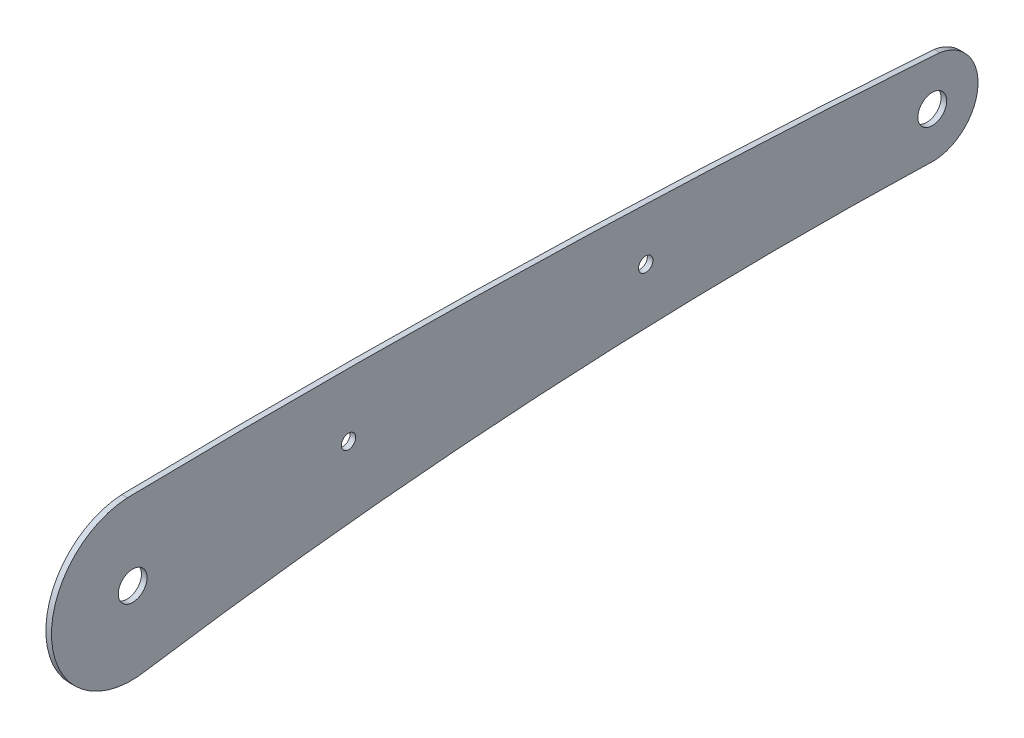
ISO-10303-21;
HEADER;
FILE_DESCRIPTION(('STEP AP214'),'2;1');
FILE_NAME('part.step','',(''),(''),'','','');
FILE_SCHEMA(('AUTOMOTIVE_DESIGN { 1 0 10303 214 1 1 1 1 }'));
ENDSEC;
DATA;
#1=APPLICATION_CONTEXT('core data for automotive mechanical design processes');
#2=APPLICATION_PROTOCOL_DEFINITION('international standard','automotive_design',2000,#1);
#3=PRODUCT_CONTEXT('',#1,'mechanical');
#4=PRODUCT('Part','Part','',(#3));
#5=PRODUCT_RELATED_PRODUCT_CATEGORY('part','',(#4));
#6=PRODUCT_DEFINITION_FORMATION('','',#4);
#7=PRODUCT_DEFINITION_CONTEXT('part definition',#1,'design');
#8=PRODUCT_DEFINITION('design','',#6,#7);
#9=PRODUCT_DEFINITION_SHAPE('','',#8);
#10=(LENGTH_UNIT() NAMED_UNIT(*) SI_UNIT(.MILLI.,.METRE.));
#11=(NAMED_UNIT(*) PLANE_ANGLE_UNIT() SI_UNIT($,.RADIAN.));
#12=(NAMED_UNIT(*) SI_UNIT($,.STERADIAN.) SOLID_ANGLE_UNIT());
#13=UNCERTAINTY_MEASURE_WITH_UNIT(LENGTH_MEASURE(1.E-05),#10,'distance_accuracy_value','');
#14=(GEOMETRIC_REPRESENTATION_CONTEXT(3) GLOBAL_UNCERTAINTY_ASSIGNED_CONTEXT((#13)) GLOBAL_UNIT_ASSIGNED_CONTEXT((#10,
#11,#12)) REPRESENTATION_CONTEXT('',''));
#15=CARTESIAN_POINT('',(0.,0.,0.));
#16=DIRECTION('',(0.,0.,1.));
#17=DIRECTION('',(1.,0.,0.));
#18=AXIS2_PLACEMENT_3D('',#15,#16,#17);
#19=CARTESIAN_POINT('',(1.5,0.0109238249300647,-111.842380336312));
#20=DIRECTION('',(1.,0.,0.));
#21=DIRECTION('',(0.,0.,-1.));
#22=AXIS2_PLACEMENT_3D('',#19,#20,#21);
#23=PLANE('',#22);
#24=CARTESIAN_POINT('',(1.5,4.68666504729787,44.4328136526777));
#25=DIRECTION('',(1.,0.,0.));
#26=DIRECTION('',(0.,0.,-1.));
#27=AXIS2_PLACEMENT_3D('',#24,#25,#26);
#28=CIRCLE('',#27,1.92499999999995);
#29=CARTESIAN_POINT('',(1.5,4.68666504729787,42.5078136526778));
#30=VERTEX_POINT('',#29);
#31=EDGE_CURVE('E171',#30,#30,#28,.T.);
#32=ORIENTED_EDGE('',*,*,#31,.F.);
#33=EDGE_LOOP('',(#32));
#34=FACE_BOUND('',#33,.T.);
#35=CARTESIAN_POINT('',(1.5,0.133331517138124,102.143981394812));
#36=DIRECTION('',(1.,0.,0.));
#37=DIRECTION('',(0.,0.,-1.));
#38=AXIS2_PLACEMENT_3D('',#35,#36,#37);
#39=CIRCLE('',#38,3.85);
#40=CARTESIAN_POINT('',(1.5,0.133331517138124,98.2939813948124));
#41=VERTEX_POINT('',#40);
#42=EDGE_CURVE('E111',#41,#41,#39,.T.);
#43=ORIENTED_EDGE('',*,*,#42,.F.);
#44=EDGE_LOOP('',(#43));
#45=FACE_BOUND('',#44,.T.);
#46=CARTESIAN_POINT('',(1.5,-3.59948538258381,-112.079421326813));
#47=DIRECTION('',(1.,0.,0.));
#48=DIRECTION('',(0.,0.,-1.));
#49=AXIS2_PLACEMENT_3D('',#46,#47,#48);
#50=CIRCLE('',#49,4.9999999999999);
#51=CARTESIAN_POINT('',(1.5,-8.57201186270506,-111.555989951663));
#52=VERTEX_POINT('',#51);
#53=CARTESIAN_POINT('',(1.5,-8.58874368837342,-112.406990492162));
#54=VERTEX_POINT('',#53);
#55=EDGE_CURVE('E116',#52,#54,#50,.T.);
#56=ORIENTED_EDGE('',*,*,#55,.T.);
#57=CARTESIAN_POINT('',(1.5,3.62133303244394,-111.605339345811));
#58=DIRECTION('',(1.,0.,0.));
#59=DIRECTION('',(0.,0.,-1.));
#60=AXIS2_PLACEMENT_3D('',#57,#58,#59);
#61=CIRCLE('',#60,12.2363645781209);
#62=CARTESIAN_POINT('',(1.5,15.6965768285633,-113.584507189356));
#63=VERTEX_POINT('',#62);
#64=EDGE_CURVE('E83',#54,#63,#61,.T.);
#65=ORIENTED_EDGE('',*,*,#64,.T.);
#66=CARTESIAN_POINT('',(1.5,-2413.07294376536,56.6324226054489));
#67=DIRECTION('',(1.,0.,0.));
#68=DIRECTION('',(0.,0.,-1.));
#69=AXIS2_PLACEMENT_3D('',#66,#67,#68);
#70=CIRCLE('',#69,2434.72692254281);
#71=CARTESIAN_POINT('',(1.5,21.2020403196569,103.541794938654));
#72=VERTEX_POINT('',#71);
#73=EDGE_CURVE('E87',#63,#72,#70,.T.);
#74=ORIENTED_EDGE('',*,*,#73,.T.);
#75=CARTESIAN_POINT('',(1.5,-0.210717527640014,102.398442674119));
#76=DIRECTION('',(1.,0.,0.));
#77=DIRECTION('',(0.,0.,-1.));
#78=AXIS2_PLACEMENT_3D('',#75,#76,#77);
#79=CIRCLE('',#78,21.4432612498145);
#80=CARTESIAN_POINT('',(1.5,-21.2449303278428,98.2300683023075));
#81=VERTEX_POINT('',#80);
#82=EDGE_CURVE('E91',#72,#81,#79,.T.);
#83=ORIENTED_EDGE('',*,*,#82,.T.);
#84=CARTESIAN_POINT('',(1.5,-1165.50616564437,-76.1691562818783));
#85=DIRECTION('',(-1.,0.,0.));
#86=DIRECTION('',(0.,0.,-1.));
#87=AXIS2_PLACEMENT_3D('',#84,#85,#86);
#88=CIRCLE('',#87,1157.475211045);
#89=EDGE_CURVE('E49',#81,#52,#88,.T.);
#90=ORIENTED_EDGE('',*,*,#89,.T.);
#91=EDGE_LOOP('',(#56,#65,#74,#83,#90));
#92=FACE_BOUND('',#91,.T.);
#93=CARTESIAN_POINT('',(1.5,5.98288182663587,-35.0010555414686));
#94=DIRECTION('',(1.,0.,0.));
#95=DIRECTION('',(0.,0.,-1.));
#96=AXIS2_PLACEMENT_3D('',#93,#94,#95);
#97=CIRCLE('',#96,1.92499999999995);
#98=CARTESIAN_POINT('',(1.5,5.98288182663587,-36.9260555414685));
#99=VERTEX_POINT('',#98);
#100=EDGE_CURVE('E177',#99,#99,#97,.T.);
#101=ORIENTED_EDGE('',*,*,#100,.F.);
#102=EDGE_LOOP('',(#101));
#103=FACE_BOUND('',#102,.T.);
#104=CARTESIAN_POINT('',(1.5,3.62133303244394,-111.605339345811));
#105=DIRECTION('',(1.,0.,0.));
#106=DIRECTION('',(0.,0.,-1.));
#107=AXIS2_PLACEMENT_3D('',#104,#105,#106);
#108=CIRCLE('',#107,3.85);
#109=CARTESIAN_POINT('',(1.5,3.62133303244394,-115.455339345811));
#110=VERTEX_POINT('',#109);
#111=EDGE_CURVE('E162',#110,#110,#108,.T.);
#112=ORIENTED_EDGE('',*,*,#111,.F.);
#113=EDGE_LOOP('',(#112));
#114=FACE_BOUND('',#113,.T.);
#115=ADVANCED_FACE('F32',(#34,#45,#92,#103,#114),#23,.T.);
#116=CARTESIAN_POINT('',(0.,0.0109238249300647,-111.842380336312));
#117=DIRECTION('',(1.,0.,0.));
#118=DIRECTION('',(0.,0.,-1.));
#119=AXIS2_PLACEMENT_3D('',#116,#117,#118);
#120=PLANE('',#119);
#121=CARTESIAN_POINT('',(0.,-3.59948538258381,-112.079421326813));
#122=DIRECTION('',(1.,0.,0.));
#123=DIRECTION('',(0.,0.,-1.));
#124=AXIS2_PLACEMENT_3D('',#121,#122,#123);
#125=CIRCLE('',#124,4.9999999999999);
#126=CARTESIAN_POINT('',(0.,-8.57201186270506,-111.555989951663));
#127=VERTEX_POINT('',#126);
#128=CARTESIAN_POINT('',(0.,-8.58874368837342,-112.406990492162));
#129=VERTEX_POINT('',#128);
#130=EDGE_CURVE('E107',#127,#129,#125,.T.);
#131=ORIENTED_EDGE('',*,*,#130,.F.);
#132=CARTESIAN_POINT('',(0.,-1165.50616564437,-76.1691562818783));
#133=DIRECTION('',(-1.,0.,0.));
#134=DIRECTION('',(0.,0.,-1.));
#135=AXIS2_PLACEMENT_3D('',#132,#133,#134);
#136=CIRCLE('',#135,1157.475211045);
#137=CARTESIAN_POINT('',(0.,-21.2449303278428,98.2300683023075));
#138=VERTEX_POINT('',#137);
#139=EDGE_CURVE('E75',#138,#127,#136,.T.);
#140=ORIENTED_EDGE('',*,*,#139,.F.);
#141=CARTESIAN_POINT('',(0.,-0.210717527640014,102.398442674119));
#142=DIRECTION('',(1.,0.,0.));
#143=DIRECTION('',(0.,0.,-1.));
#144=AXIS2_PLACEMENT_3D('',#141,#142,#143);
#145=CIRCLE('',#144,21.4432612498145);
#146=CARTESIAN_POINT('',(0.,21.2020403196569,103.541794938654));
#147=VERTEX_POINT('',#146);
#148=EDGE_CURVE('E69',#147,#138,#145,.T.);
#149=ORIENTED_EDGE('',*,*,#148,.F.);
#150=CARTESIAN_POINT('',(0.,-2413.07294376536,56.6324226054489));
#151=DIRECTION('',(1.,0.,0.));
#152=DIRECTION('',(0.,0.,-1.));
#153=AXIS2_PLACEMENT_3D('',#150,#151,#152);
#154=CIRCLE('',#153,2434.72692254281);
#155=CARTESIAN_POINT('',(0.,15.6965768285633,-113.584507189356));
#156=VERTEX_POINT('',#155);
#157=EDGE_CURVE('E98',#156,#147,#154,.T.);
#158=ORIENTED_EDGE('',*,*,#157,.F.);
#159=CARTESIAN_POINT('',(0.,3.62133303244394,-111.605339345811));
#160=DIRECTION('',(1.,0.,0.));
#161=DIRECTION('',(0.,0.,-1.));
#162=AXIS2_PLACEMENT_3D('',#159,#160,#161);
#163=CIRCLE('',#162,12.2363645781209);
#164=EDGE_CURVE('E110',#129,#156,#163,.T.);
#165=ORIENTED_EDGE('',*,*,#164,.F.);
#166=EDGE_LOOP('',(#131,#140,#149,#158,#165));
#167=FACE_BOUND('',#166,.T.);
#168=CARTESIAN_POINT('',(0.,0.133331517138124,102.143981394812));
#169=DIRECTION('',(1.,0.,0.));
#170=DIRECTION('',(0.,0.,-1.));
#171=AXIS2_PLACEMENT_3D('',#168,#169,#170);
#172=CIRCLE('',#171,3.85);
#173=CARTESIAN_POINT('',(0.,0.133331517138124,98.2939813948124));
#174=VERTEX_POINT('',#173);
#175=EDGE_CURVE('E180',#174,#174,#172,.T.);
#176=ORIENTED_EDGE('',*,*,#175,.T.);
#177=EDGE_LOOP('',(#176));
#178=FACE_BOUND('',#177,.T.);
#179=CARTESIAN_POINT('',(0.,5.98288182663587,-35.0010555414686));
#180=DIRECTION('',(1.,0.,0.));
#181=DIRECTION('',(0.,0.,-1.));
#182=AXIS2_PLACEMENT_3D('',#179,#180,#181);
#183=CIRCLE('',#182,1.92499999999995);
#184=CARTESIAN_POINT('',(0.,5.98288182663587,-36.9260555414685));
#185=VERTEX_POINT('',#184);
#186=EDGE_CURVE('E174',#185,#185,#183,.T.);
#187=ORIENTED_EDGE('',*,*,#186,.T.);
#188=EDGE_LOOP('',(#187));
#189=FACE_BOUND('',#188,.T.);
#190=CARTESIAN_POINT('',(0.,4.68666504729787,44.4328136526777));
#191=DIRECTION('',(1.,0.,0.));
#192=DIRECTION('',(0.,0.,-1.));
#193=AXIS2_PLACEMENT_3D('',#190,#191,#192);
#194=CIRCLE('',#193,1.92499999999995);
#195=CARTESIAN_POINT('',(0.,4.68666504729787,42.5078136526778));
#196=VERTEX_POINT('',#195);
#197=EDGE_CURVE('E168',#196,#196,#194,.T.);
#198=ORIENTED_EDGE('',*,*,#197,.T.);
#199=EDGE_LOOP('',(#198));
#200=FACE_BOUND('',#199,.T.);
#201=CARTESIAN_POINT('',(0.,3.62133303244394,-111.605339345811));
#202=DIRECTION('',(1.,0.,0.));
#203=DIRECTION('',(0.,0.,-1.));
#204=AXIS2_PLACEMENT_3D('',#201,#202,#203);
#205=CIRCLE('',#204,3.85);
#206=CARTESIAN_POINT('',(0.,3.62133303244394,-115.455339345811));
#207=VERTEX_POINT('',#206);
#208=EDGE_CURVE('E165',#207,#207,#205,.T.);
#209=ORIENTED_EDGE('',*,*,#208,.T.);
#210=EDGE_LOOP('',(#209));
#211=FACE_BOUND('',#210,.T.);
#212=ADVANCED_FACE('F120',(#167,#178,#189,#200,#211),#120,.F.);
#213=CARTESIAN_POINT('',(1.5,-3.59948538258381,-112.079421326813));
#214=DIRECTION('',(-1.,0.,0.));
#215=DIRECTION('',(0.,0.,1.));
#216=AXIS2_PLACEMENT_3D('',#213,#214,#215);
#217=CYLINDRICAL_SURFACE('',#216,4.9999999999999);
#218=ORIENTED_EDGE('',*,*,#130,.T.);
#219=DIRECTION('',(-1.,0.,0.));
#220=VECTOR('',#219,1.);
#221=CARTESIAN_POINT('',(1.5,-8.58874368837342,-112.406990492162));
#222=LINE('',#221,#220);
#223=EDGE_CURVE('E11',#54,#129,#222,.T.);
#224=ORIENTED_EDGE('',*,*,#223,.F.);
#225=ORIENTED_EDGE('',*,*,#55,.F.);
#226=DIRECTION('',(-1.,0.,0.));
#227=VECTOR('',#226,1.);
#228=CARTESIAN_POINT('',(1.5,-8.57201186270506,-111.555989951663));
#229=LINE('',#228,#227);
#230=EDGE_CURVE('E103',#52,#127,#229,.T.);
#231=ORIENTED_EDGE('',*,*,#230,.T.);
#232=EDGE_LOOP('',(#218,#224,#225,#231));
#233=FACE_BOUND('',#232,.T.);
#234=ADVANCED_FACE('F34',(#233),#217,.T.);
#235=CARTESIAN_POINT('',(1.5,3.62133303244394,-111.605339345811));
#236=DIRECTION('',(-1.,0.,0.));
#237=DIRECTION('',(0.,0.,1.));
#238=AXIS2_PLACEMENT_3D('',#235,#236,#237);
#239=CYLINDRICAL_SURFACE('',#238,12.2363645781209);
#240=ORIENTED_EDGE('',*,*,#164,.T.);
#241=DIRECTION('',(-1.,0.,0.));
#242=VECTOR('',#241,1.);
#243=CARTESIAN_POINT('',(1.5,15.6965768285633,-113.584507189356));
#244=LINE('',#243,#242);
#245=EDGE_CURVE('E41',#63,#156,#244,.T.);
#246=ORIENTED_EDGE('',*,*,#245,.F.);
#247=ORIENTED_EDGE('',*,*,#64,.F.);
#248=ORIENTED_EDGE('',*,*,#223,.T.);
#249=EDGE_LOOP('',(#240,#246,#247,#248));
#250=FACE_BOUND('',#249,.T.);
#251=ADVANCED_FACE('F229',(#250),#239,.T.);
#252=CARTESIAN_POINT('',(1.5,-2413.07294376536,56.6324226054489));
#253=DIRECTION('',(-1.,0.,0.));
#254=DIRECTION('',(0.,0.,1.));
#255=AXIS2_PLACEMENT_3D('',#252,#253,#254);
#256=CYLINDRICAL_SURFACE('',#255,2434.72692254281);
#257=ORIENTED_EDGE('',*,*,#157,.T.);
#258=DIRECTION('',(-1.,0.,0.));
#259=VECTOR('',#258,1.);
#260=CARTESIAN_POINT('',(1.5,21.2020403196569,103.541794938654));
#261=LINE('',#260,#259);
#262=EDGE_CURVE('E95',#72,#147,#261,.T.);
#263=ORIENTED_EDGE('',*,*,#262,.F.);
#264=ORIENTED_EDGE('',*,*,#73,.F.);
#265=ORIENTED_EDGE('',*,*,#245,.T.);
#266=EDGE_LOOP('',(#257,#263,#264,#265));
#267=FACE_BOUND('',#266,.T.);
#268=ADVANCED_FACE('F96',(#267),#256,.T.);
#269=CARTESIAN_POINT('',(1.5,-0.210717527640014,102.398442674119));
#270=DIRECTION('',(-1.,0.,0.));
#271=DIRECTION('',(0.,0.,1.));
#272=AXIS2_PLACEMENT_3D('',#269,#270,#271);
#273=CYLINDRICAL_SURFACE('',#272,21.4432612498145);
#274=ORIENTED_EDGE('',*,*,#148,.T.);
#275=DIRECTION('',(-1.,0.,0.));
#276=VECTOR('',#275,1.);
#277=CARTESIAN_POINT('',(1.5,-21.2449303278428,98.2300683023075));
#278=LINE('',#277,#276);
#279=EDGE_CURVE('E99',#81,#138,#278,.T.);
#280=ORIENTED_EDGE('',*,*,#279,.F.);
#281=ORIENTED_EDGE('',*,*,#82,.F.);
#282=ORIENTED_EDGE('',*,*,#262,.T.);
#283=EDGE_LOOP('',(#274,#280,#281,#282));
#284=FACE_BOUND('',#283,.T.);
#285=ADVANCED_FACE('F101',(#284),#273,.T.);
#286=CARTESIAN_POINT('',(1.5,-1165.50616564437,-76.1691562818783));
#287=DIRECTION('',(-1.,0.,0.));
#288=DIRECTION('',(0.,0.,1.));
#289=AXIS2_PLACEMENT_3D('',#286,#287,#288);
#290=CYLINDRICAL_SURFACE('',#289,1157.475211045);
#291=ORIENTED_EDGE('',*,*,#139,.T.);
#292=ORIENTED_EDGE('',*,*,#230,.F.);
#293=ORIENTED_EDGE('',*,*,#89,.F.);
#294=ORIENTED_EDGE('',*,*,#279,.T.);
#295=EDGE_LOOP('',(#291,#292,#293,#294));
#296=FACE_BOUND('',#295,.T.);
#297=ADVANCED_FACE('F125',(#296),#290,.F.);
#298=CARTESIAN_POINT('',(1.5,0.133331517138124,102.143981394812));
#299=DIRECTION('',(-1.,0.,0.));
#300=DIRECTION('',(0.,0.,1.));
#301=AXIS2_PLACEMENT_3D('',#298,#299,#300);
#302=CYLINDRICAL_SURFACE('',#301,3.85);
#303=ORIENTED_EDGE('',*,*,#42,.T.);
#304=EDGE_LOOP('',(#303));
#305=FACE_BOUND('',#304,.T.);
#306=ORIENTED_EDGE('',*,*,#175,.F.);
#307=EDGE_LOOP('',(#306));
#308=FACE_BOUND('',#307,.T.);
#309=ADVANCED_FACE('F127',(#305,#308),#302,.F.);
#310=CARTESIAN_POINT('',(1.5,5.98288182663587,-35.0010555414686));
#311=DIRECTION('',(-1.,0.,0.));
#312=DIRECTION('',(0.,0.,1.));
#313=AXIS2_PLACEMENT_3D('',#310,#311,#312);
#314=CYLINDRICAL_SURFACE('',#313,1.92499999999995);
#315=ORIENTED_EDGE('',*,*,#100,.T.);
#316=EDGE_LOOP('',(#315));
#317=FACE_BOUND('',#316,.T.);
#318=ORIENTED_EDGE('',*,*,#186,.F.);
#319=EDGE_LOOP('',(#318));
#320=FACE_BOUND('',#319,.T.);
#321=ADVANCED_FACE('F133',(#317,#320),#314,.F.);
#322=CARTESIAN_POINT('',(1.5,4.68666504729787,44.4328136526777));
#323=DIRECTION('',(-1.,0.,0.));
#324=DIRECTION('',(0.,0.,1.));
#325=AXIS2_PLACEMENT_3D('',#322,#323,#324);
#326=CYLINDRICAL_SURFACE('',#325,1.92499999999995);
#327=ORIENTED_EDGE('',*,*,#31,.T.);
#328=EDGE_LOOP('',(#327));
#329=FACE_BOUND('',#328,.T.);
#330=ORIENTED_EDGE('',*,*,#197,.F.);
#331=EDGE_LOOP('',(#330));
#332=FACE_BOUND('',#331,.T.);
#333=ADVANCED_FACE('F149',(#329,#332),#326,.F.);
#334=CARTESIAN_POINT('',(1.5,3.62133303244394,-111.605339345811));
#335=DIRECTION('',(-1.,0.,0.));
#336=DIRECTION('',(0.,0.,1.));
#337=AXIS2_PLACEMENT_3D('',#334,#335,#336);
#338=CYLINDRICAL_SURFACE('',#337,3.85);
#339=ORIENTED_EDGE('',*,*,#111,.T.);
#340=EDGE_LOOP('',(#339));
#341=FACE_BOUND('',#340,.T.);
#342=ORIENTED_EDGE('',*,*,#208,.F.);
#343=EDGE_LOOP('',(#342));
#344=FACE_BOUND('',#343,.T.);
#345=ADVANCED_FACE('F153',(#341,#344),#338,.F.);
#346=CLOSED_SHELL('',(#115,#212,#234,#251,#268,#285,#297,#309,#321,#333,#345));
#347=MANIFOLD_SOLID_BREP('B2',#346);
#348=ADVANCED_BREP_SHAPE_REPRESENTATION('',(#18,#347),#14);
#349=SHAPE_DEFINITION_REPRESENTATION(#9,#348);
ENDSEC;
END-ISO-10303-21;
